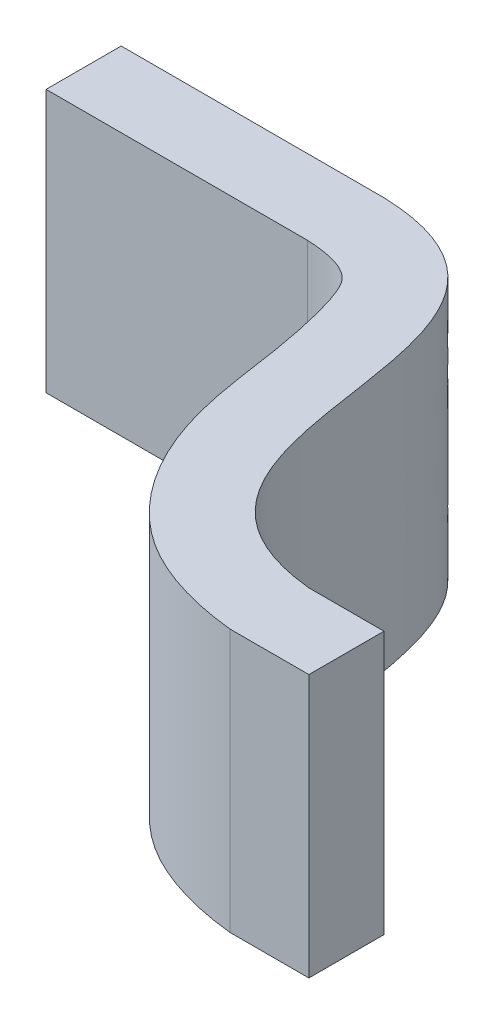
ISO-10303-21;
HEADER;
FILE_DESCRIPTION(('STEP AP214'),'2;1');
FILE_NAME('part.step','',(''),(''),'','','');
FILE_SCHEMA(('AUTOMOTIVE_DESIGN { 1 0 10303 214 1 1 1 1 }'));
ENDSEC;
DATA;
#1=APPLICATION_CONTEXT('core data for automotive mechanical design processes');
#2=APPLICATION_PROTOCOL_DEFINITION('international standard','automotive_design',2000,#1);
#3=PRODUCT_CONTEXT('',#1,'mechanical');
#4=PRODUCT('Part','Part','',(#3));
#5=PRODUCT_RELATED_PRODUCT_CATEGORY('part','',(#4));
#6=PRODUCT_DEFINITION_FORMATION('','',#4);
#7=PRODUCT_DEFINITION_CONTEXT('part definition',#1,'design');
#8=PRODUCT_DEFINITION('design','',#6,#7);
#9=PRODUCT_DEFINITION_SHAPE('','',#8);
#10=(LENGTH_UNIT() NAMED_UNIT(*) SI_UNIT(.MILLI.,.METRE.));
#11=(NAMED_UNIT(*) PLANE_ANGLE_UNIT() SI_UNIT($,.RADIAN.));
#12=(NAMED_UNIT(*) SI_UNIT($,.STERADIAN.) SOLID_ANGLE_UNIT());
#13=UNCERTAINTY_MEASURE_WITH_UNIT(LENGTH_MEASURE(1.E-05),#10,'distance_accuracy_value','');
#14=(GEOMETRIC_REPRESENTATION_CONTEXT(3) GLOBAL_UNCERTAINTY_ASSIGNED_CONTEXT((#13)) GLOBAL_UNIT_ASSIGNED_CONTEXT((#10,
#11,#12)) REPRESENTATION_CONTEXT('',''));
#15=CARTESIAN_POINT('',(0.,0.,0.));
#16=DIRECTION('',(0.,0.,1.));
#17=DIRECTION('',(1.,0.,0.));
#18=AXIS2_PLACEMENT_3D('',#15,#16,#17);
#19=CARTESIAN_POINT('',(0.381062000989914,-3.47687603414217,1.19999985356685));
#20=DIRECTION('',(0.,-1.,-4.37113882867379E-08));
#21=DIRECTION('',(1.,0.,0.));
#22=AXIS2_PLACEMENT_3D('',#19,#20,#21);
#23=PLANE('',#22);
#24=CARTESIAN_POINT('',(-6.65393799901009,-3.47687602539989,0.999999853566849));
#25=CARTESIAN_POINT('',(-6.67603378247592,-3.47687602530467,0.997821363378807));
#26=CARTESIAN_POINT('',(-6.69814608533159,-3.47687602516058,0.994524992319807));
#27=CARTESIAN_POINT('',(-6.74196000230599,-3.47687602474309,0.984973999806053));
#28=CARTESIAN_POINT('',(-6.76365439120462,-3.47687602446828,0.978687133446072));
#29=CARTESIAN_POINT('',(-6.80109928914061,-3.47687602383577,0.964217061903686));
#30=CARTESIAN_POINT('',(-6.81711598043367,-3.47687602350913,0.95674415768129));
#31=CARTESIAN_POINT('',(-6.84771104371223,-3.47687602275081,0.93939591098382));
#32=CARTESIAN_POINT('',(-6.86229582381613,-3.47687602231964,0.929532028551954));
#33=CARTESIAN_POINT('',(-6.88913715455262,-3.47687602137223,0.907857820702243));
#34=CARTESIAN_POINT('',(-6.90145549336788,-3.47687602085934,0.896124080689937));
#35=CARTESIAN_POINT('',(-6.92410333203055,-3.47687601975463,0.870851202194948));
#36=CARTESIAN_POINT('',(-6.93442941955475,-3.47687601916268,0.857309032186525));
#37=CARTESIAN_POINT('',(-6.96672356560466,-3.47687601701589,0.80819639399189));
#38=CARTESIAN_POINT('',(-6.98364579428103,-3.47687601531836,0.769361408858454));
#39=CARTESIAN_POINT('',(-7.00637915120374,-3.47687601228944,0.700067620687223));
#40=CARTESIAN_POINT('',(-7.01393277364121,-3.47687601097706,0.670043871769164));
#41=CARTESIAN_POINT('',(-7.02681062279047,-3.47687600832878,0.609458291277651));
#42=CARTESIAN_POINT('',(-7.03213106678493,-3.47687600699284,0.578895637360987));
#43=CARTESIAN_POINT('',(-7.04523612787774,-3.476876003414,0.497021351625422));
#44=CARTESIAN_POINT('',(-7.0522656284455,-3.4768760011665,0.445604528778749));
#45=CARTESIAN_POINT('',(-7.06583829430569,-3.47687599781692,0.368975045837082));
#46=CARTESIAN_POINT('',(-7.0708647695897,-3.47687599670442,0.34352407936554));
#47=CARTESIAN_POINT('',(-7.08290131021325,-3.4768759945012,0.293120201610463));
#48=CARTESIAN_POINT('',(-7.08990811721131,-3.47687599341044,0.268166543683047));
#49=CARTESIAN_POINT('',(-7.10754242158977,-3.47687599122937,0.218269493752244));
#50=CARTESIAN_POINT('',(-7.11830963205074,-3.47687599014101,0.193370554013012));
#51=CARTESIAN_POINT('',(-7.13814509854049,-3.47687598860283,0.158181114031217));
#52=CARTESIAN_POINT('',(-7.14534233177561,-3.47687598810726,0.146843820328251));
#53=CARTESIAN_POINT('',(-7.16105988122924,-3.47687598715831,0.12513440622176));
#54=CARTESIAN_POINT('',(-7.16957893209141,-3.47687598670489,0.114761377771715));
#55=CARTESIAN_POINT('',(-7.19091439754605,-3.47687598571421,0.0920974605824842));
#56=CARTESIAN_POINT('',(-7.20423043199209,-3.47687598519713,0.0802678988908227));
#57=CARTESIAN_POINT('',(-7.23280529274656,-3.47687598427693,0.0592160823492717));
#58=CARTESIAN_POINT('',(-7.24806736713441,-3.476875983874,0.0499982715306272));
#59=CARTESIAN_POINT('',(-7.28055680499388,-3.47687598316908,0.0338716888207497));
#60=CARTESIAN_POINT('',(-7.29784019259106,-3.47687598287213,0.0270780092305782));
#61=CARTESIAN_POINT('',(-7.33320890349723,-3.47687598238776,0.015996926953099));
#62=CARTESIAN_POINT('',(-7.35129600434054,-3.4768759822006,0.0117154108145131));
#63=CARTESIAN_POINT('',(-7.383534227059,-3.47687598194947,0.00597036540082539));
#64=CARTESIAN_POINT('',(-7.39761496113673,-3.47687598186692,0.00408168117578884));
#65=CARTESIAN_POINT('',(-7.42577624030721,-3.47687598174668,0.00133069078066433));
#66=CARTESIAN_POINT('',(-7.43985605615936,-3.47687598170867,0.000461089362856915));
#67=CARTESIAN_POINT('',(-7.45393799901012,-3.4768759816885,-1.46433151940948E-07));
#68=B_SPLINE_CURVE_WITH_KNOTS('',3,(#24,#25,#26,#27,#28,#29,#30,#31,#32,#33,#34,#35,#36,#37,#38,
#39,#40,#41,#42,#43,#44,#45,#46,#47,#48,#49,#50,#51,#52,#53,#54,#55,#56,#57,#58,#59,#60,#61,#62,
#63,#64,#65,#66,#67),.UNSPECIFIED.,.F.,.F.,(4,2,2,2,2,2,2,2,2,2,2,2,2,2,2,2,2,2,2,2,2,4),(0.,
0.0667821137090835,0.134301214684022,0.187128508823985,0.239707439757734,0.290518731452927,
0.341416294675053,0.466712259088968,0.559563019654505,0.652570428897917,0.808245450373591,
0.886023921415192,0.963675157190782,1.0445878496654,1.08478909463836,1.12495209032637,
1.17807587168456,1.23128951042009,1.2867700351769,1.34238004906254,1.38496468867344,
1.42724258099922),.UNSPECIFIED.);
#69=CARTESIAN_POINT('',(-6.65393799901009,-3.47687602539989,0.999999853566849));
#70=VERTEX_POINT('',#69);
#71=CARTESIAN_POINT('',(-7.45393799901009,-3.4768759816885,-1.46433150760572E-07));
#72=VERTEX_POINT('',#71);
#73=EDGE_CURVE('E11',#70,#72,#68,.T.);
#74=ORIENTED_EDGE('',*,*,#73,.F.);
#75=DIRECTION('',(-1.,0.,0.));
#76=VECTOR('',#75,1.);
#77=CARTESIAN_POINT('',(-6.45393799901009,-3.47687602539989,0.999999853566849));
#78=LINE('',#77,#76);
#79=CARTESIAN_POINT('',(-6.45393799901009,-3.47687602539989,0.999999853566849));
#80=VERTEX_POINT('',#79);
#81=EDGE_CURVE('E178',#80,#70,#78,.T.);
#82=ORIENTED_EDGE('',*,*,#81,.F.);
#83=DIRECTION('',(0.,4.37113878426487E-08,-0.999999999999999));
#84=VECTOR('',#83,1.);
#85=CARTESIAN_POINT('',(-6.45393799901009,-3.47687603414217,1.19999985356685));
#86=LINE('',#85,#84);
#87=CARTESIAN_POINT('',(-6.45393799901009,-3.47687603414217,1.19999985356685));
#88=VERTEX_POINT('',#87);
#89=EDGE_CURVE('E154',#88,#80,#86,.T.);
#90=ORIENTED_EDGE('',*,*,#89,.F.);
#91=DIRECTION('',(-1.,0.,0.));
#92=VECTOR('',#91,1.);
#93=CARTESIAN_POINT('',(-6.45393799901009,-3.47687603414216,1.19999985356685));
#94=LINE('',#93,#92);
#95=CARTESIAN_POINT('',(-6.66373717585809,-3.47687603414217,1.19999985356685));
#96=VERTEX_POINT('',#95);
#97=EDGE_CURVE('E147',#88,#96,#94,.T.);
#98=ORIENTED_EDGE('',*,*,#97,.T.);
#99=CARTESIAN_POINT('',(-6.66373717585809,-3.47687603414217,1.19999985356685));
#100=CARTESIAN_POINT('',(-6.68237056257263,-3.47687603406166,1.19815800024526));
#101=CARTESIAN_POINT('',(-6.70094738722954,-3.47687603395427,1.1957012238173));
#102=CARTESIAN_POINT('',(-6.73792461054779,-3.47687603368307,1.18949682423011));
#103=CARTESIAN_POINT('',(-6.75632454194431,-3.47687603351913,1.18574642673535));
#104=CARTESIAN_POINT('',(-6.7929675339705,-3.47687603313076,1.1768614504023));
#105=CARTESIAN_POINT('',(-6.81120769181061,-3.47687603290579,1.17171471620827));
#106=CARTESIAN_POINT('',(-6.84718412122,-3.47687603239066,1.15992992349783));
#107=CARTESIAN_POINT('',(-6.86492077676558,-3.47687603210055,1.15329303778762));
#108=CARTESIAN_POINT('',(-6.90550702441668,-3.47687603133701,1.13582532460973));
#109=CARTESIAN_POINT('',(-6.92808530032362,-3.47687603083472,1.12433411949994));
#110=CARTESIAN_POINT('',(-6.97098069443299,-3.47687602967858,1.09788489937365));
#111=CARTESIAN_POINT('',(-6.99130790145501,-3.47687602902546,1.08294336266544));
#112=CARTESIAN_POINT('',(-7.0279727762332,-3.47687602765227,1.05152836561377));
#113=CARTESIAN_POINT('',(-7.04449924398274,-3.47687602694167,1.03527166959651));
#114=CARTESIAN_POINT('',(-7.07543365798621,-3.47687602543449,1.00079135092782));
#115=CARTESIAN_POINT('',(-7.08983601944683,-3.47687602463769,0.98256275412625));
#116=CARTESIAN_POINT('',(-7.11809776879426,-3.47687602287818,0.942309972603253));
#117=CARTESIAN_POINT('',(-7.13168204827002,-3.47687602190706,0.92009318612408));
#118=CARTESIAN_POINT('',(-7.15606790009834,-3.47687601990227,0.874228970980329));
#119=CARTESIAN_POINT('',(-7.16687319447414,-3.47687601886869,0.850583508813255));
#120=CARTESIAN_POINT('',(-7.18657911699553,-3.4768760166685,0.800248980346848));
#121=CARTESIAN_POINT('',(-7.19524763842127,-3.47687601549796,0.773470089068371));
#122=CARTESIAN_POINT('',(-7.20996785968964,-3.4768760131256,0.719196833192921));
#123=CARTESIAN_POINT('',(-7.21601637646933,-3.47687601192374,0.691701641089337));
#124=CARTESIAN_POINT('',(-7.22445706680594,-3.47687600995746,0.646718436338351));
#125=CARTESIAN_POINT('',(-7.22737168105378,-3.47687600919702,0.629321297123909));
#126=CARTESIAN_POINT('',(-7.23282112861414,-3.4768760076734,0.594464888859918));
#127=CARTESIAN_POINT('',(-7.23535587567411,-3.47687600691023,0.57700560661871));
#128=CARTESIAN_POINT('',(-7.24044379035748,-3.47687600538413,0.542092659422762));
#129=CARTESIAN_POINT('',(-7.24299695433449,-3.47687600462121,0.524638994034041));
#130=CARTESIAN_POINT('',(-7.24854024165721,-3.47687600309859,0.489805448400219));
#131=CARTESIAN_POINT('',(-7.25153024685593,-3.47687600233889,0.472425549508169));
#132=CARTESIAN_POINT('',(-7.25940543221582,-3.47687600048514,0.430016740032559));
#133=CARTESIAN_POINT('',(-7.26454124775706,-3.47687599939302,0.405032011816055));
#134=CARTESIAN_POINT('',(-7.27335782095331,-3.47687599776612,0.367812734985583));
#135=CARTESIAN_POINT('',(-7.27648289514104,-3.4768759972256,0.355446814341552));
#136=CARTESIAN_POINT('',(-7.2832453862984,-3.47687599615076,0.33085792341073));
#137=CARTESIAN_POINT('',(-7.28688251537886,-3.47687599561644,0.318634876950397));
#138=CARTESIAN_POINT('',(-7.29335647517369,-3.47687599477455,0.29937322121594));
#139=CARTESIAN_POINT('',(-7.29591902475202,-3.47687599446296,0.29224380744469));
#140=CARTESIAN_POINT('',(-7.30149713681058,-3.47687599384772,0.278171719353253));
#141=CARTESIAN_POINT('',(-7.30451201316556,-3.47687599354405,0.271228780663557));
#142=CARTESIAN_POINT('',(-7.31077994191444,-3.47687599300993,0.258999768411458));
#143=CARTESIAN_POINT('',(-7.31388605246379,-3.47687599277632,0.253644591727611));
#144=CARTESIAN_POINT('',(-7.32081621454635,-3.47687599236733,0.244315850731122));
#145=CARTESIAN_POINT('',(-7.32451240161513,-3.47687599218833,0.240253829951383));
#146=CARTESIAN_POINT('',(-7.33396137139944,-3.47687599183599,0.232075819782309));
#147=CARTESIAN_POINT('',(-7.33999881820825,-3.47687599168021,0.228303905554504));
#148=CARTESIAN_POINT('',(-7.34921547868647,-3.47687599144317,0.223112945284578));
#149=CARTESIAN_POINT('',(-7.35230200427145,-3.4768759913639,0.221466013892202));
#150=CARTESIAN_POINT('',(-7.35859228869369,-3.47687599124101,0.218417225329415));
#151=CARTESIAN_POINT('',(-7.36179572518167,-3.47687599119728,0.217014747998717));
#152=CARTESIAN_POINT('',(-7.37091592035366,-3.47687599106817,0.21346489598315));
#153=CARTESIAN_POINT('',(-7.37694933123149,-3.47687599097749,0.211621552848283));
#154=CARTESIAN_POINT('',(-7.38671809463102,-3.47687599084498,0.209137060916209));
#155=CARTESIAN_POINT('',(-7.3904112741511,-3.47687599079807,0.208309546645722));
#156=CARTESIAN_POINT('',(-7.39782685498994,-3.47687599072394,0.206799511724329));
#157=CARTESIAN_POINT('',(-7.40154925199958,-3.47687599069671,0.206116970094036));
#158=CARTESIAN_POINT('',(-7.41391207862736,-3.47687599061041,0.204031929793531));
#159=CARTESIAN_POINT('',(-7.42259188256675,-3.47687599055652,0.20286096389716));
#160=CARTESIAN_POINT('',(-7.43564284724014,-3.47687599049499,0.201476448842085));
#161=CARTESIAN_POINT('',(-7.4399954739608,-3.4768759904777,0.201077075020748));
#162=CARTESIAN_POINT('',(-7.44871111958986,-3.47687599044948,0.200423844313514));
#163=CARTESIAN_POINT('',(-7.45307413753338,-3.47687599043856,0.200169974408029));
#164=CARTESIAN_POINT('',(-7.45744178074609,-3.47687599043078,0.199999853566849));
#165=B_SPLINE_CURVE_WITH_KNOTS('',3,(#99,#100,#101,#102,#103,#104,#105,#106,#107,#108,#109,#110,
#111,#112,#113,#114,#115,#116,#117,#118,#119,#120,#121,#122,#123,#124,#125,#126,#127,#128,#129,
#130,#131,#132,#133,#134,#135,#136,#137,#138,#139,#140,#141,#142,#143,#144,#145,#146,#147,#148,
#149,#150,#151,#152,#153,#154,#155,#156,#157,#158,#159,#160,#161,#162,#163,#164),.UNSPECIFIED.,
.F.,.F.,(4,2,2,2,2,2,2,2,2,2,2,2,2,2,2,2,2,2,2,2,2,2,2,2,2,2,2,2,2,2,2,2,4),(0.,
0.0561681589095697,0.112457534383135,0.169253578612363,0.226005077906877,0.301715004036535,
0.377070566345992,0.446424912055148,0.515958475234815,0.593880428548583,0.671697467408243,
0.755964517163008,0.840333658382208,0.893247792631838,0.946173923407371,0.999089848164162,
1.05199148781442,1.12847716172405,1.16673541076623,1.20497223539783,1.22769072756633,
1.25037510056686,1.26886797593494,1.28517999290264,1.30634908955326,1.31685139211729,
1.32732665061524,1.34619861049413,1.3575513722042,1.36890248990408,1.39515927363249,
1.40827024085607,1.42138003473644),.UNSPECIFIED.);
#166=CARTESIAN_POINT('',(-7.45744178074609,-3.47687599043078,0.199999853566849));
#167=VERTEX_POINT('',#166);
#168=EDGE_CURVE('E196',#96,#167,#165,.T.);
#169=ORIENTED_EDGE('',*,*,#168,.T.);
#170=DIRECTION('',(1.,0.,0.));
#171=VECTOR('',#170,1.);
#172=CARTESIAN_POINT('',(-8.15393799901009,-3.47687599043078,0.199999853566847));
#173=LINE('',#172,#171);
#174=CARTESIAN_POINT('',(-8.15393799901009,-3.47687599043078,0.199999853566849));
#175=VERTEX_POINT('',#174);
#176=EDGE_CURVE('E102',#175,#167,#173,.T.);
#177=ORIENTED_EDGE('',*,*,#176,.F.);
#178=DIRECTION('',(0.,4.37113900630947E-08,-0.999999999999999));
#179=VECTOR('',#178,1.);
#180=CARTESIAN_POINT('',(-8.15393799901009,-3.47687599043078,0.199999853566849));
#181=LINE('',#180,#179);
#182=CARTESIAN_POINT('',(-8.15393799901009,-3.4768759816885,-1.46433150760572E-07));
#183=VERTEX_POINT('',#182);
#184=EDGE_CURVE('E90',#175,#183,#181,.T.);
#185=ORIENTED_EDGE('',*,*,#184,.T.);
#186=DIRECTION('',(-1.,0.,0.));
#187=VECTOR('',#186,1.);
#188=CARTESIAN_POINT('',(-7.45393799901009,-3.4768759816885,-1.46433150760572E-07));
#189=LINE('',#188,#187);
#190=EDGE_CURVE('E100',#72,#183,#189,.T.);
#191=ORIENTED_EDGE('',*,*,#190,.F.);
#192=EDGE_LOOP('',(#74,#82,#90,#98,#169,#177,#185,#191));
#193=FACE_BOUND('',#192,.T.);
#194=ADVANCED_FACE('F17',(#193),#23,.T.);
#195=CARTESIAN_POINT('',(0.381062000989914,-2.77687603414217,1.19999988416482));
#196=DIRECTION('',(0.,-1.,-4.37113882867379E-08));
#197=DIRECTION('',(1.,0.,0.));
#198=AXIS2_PLACEMENT_3D('',#195,#196,#197);
#199=PLANE('',#198);
#200=DIRECTION('',(-1.,0.,0.));
#201=VECTOR('',#200,1.);
#202=CARTESIAN_POINT('',(-6.45393799901009,-2.77687602539989,0.999999884164821));
#203=LINE('',#202,#201);
#204=CARTESIAN_POINT('',(-6.45393799901009,-2.77687602539989,0.999999884164821));
#205=VERTEX_POINT('',#204);
#206=CARTESIAN_POINT('',(-6.65393799901009,-2.77687602539989,0.999999884164821));
#207=VERTEX_POINT('',#206);
#208=EDGE_CURVE('E30',#205,#207,#203,.T.);
#209=ORIENTED_EDGE('',*,*,#208,.T.);
#210=CARTESIAN_POINT('',(-6.65393799901009,-2.77687602539989,0.999999884164821));
#211=CARTESIAN_POINT('',(-6.67603378247592,-2.77687602530467,0.997821393976779));
#212=CARTESIAN_POINT('',(-6.69814608533159,-2.77687602516058,0.99452502291778));
#213=CARTESIAN_POINT('',(-6.74196000230599,-2.77687602474309,0.984974030404025));
#214=CARTESIAN_POINT('',(-6.76365439120462,-2.77687602446828,0.978687164044045));
#215=CARTESIAN_POINT('',(-6.80109928914061,-2.77687602383578,0.964217092501658));
#216=CARTESIAN_POINT('',(-6.81711598043367,-2.77687602350913,0.956744188279261));
#217=CARTESIAN_POINT('',(-6.84771104371223,-2.77687602275081,0.939395941581792));
#218=CARTESIAN_POINT('',(-6.86229582381613,-2.77687602231964,0.929532059149926));
#219=CARTESIAN_POINT('',(-6.88913715455262,-2.77687602137223,0.907857851300216));
#220=CARTESIAN_POINT('',(-6.90145549336788,-2.77687602085934,0.896124111287909));
#221=CARTESIAN_POINT('',(-6.92410333203055,-2.77687601975463,0.870851232792921));
#222=CARTESIAN_POINT('',(-6.93442941955475,-2.77687601916268,0.857309062784497));
#223=CARTESIAN_POINT('',(-6.96672356560466,-2.77687601701589,0.808196424589862));
#224=CARTESIAN_POINT('',(-6.98364579428104,-2.77687601531836,0.769361439456425));
#225=CARTESIAN_POINT('',(-7.00637915120374,-2.77687601228944,0.700067651285194));
#226=CARTESIAN_POINT('',(-7.01393277364121,-2.77687601097706,0.670043902367135));
#227=CARTESIAN_POINT('',(-7.02681062279047,-2.77687600832878,0.609458321875622));
#228=CARTESIAN_POINT('',(-7.03213106678493,-2.77687600699284,0.578895667958958));
#229=CARTESIAN_POINT('',(-7.04523612787774,-2.776876003414,0.497021382223394));
#230=CARTESIAN_POINT('',(-7.0522656284455,-2.7768760011665,0.44560455937672));
#231=CARTESIAN_POINT('',(-7.06583829430569,-2.77687599781692,0.368975076435053));
#232=CARTESIAN_POINT('',(-7.0708647695897,-2.77687599670443,0.343524109963512));
#233=CARTESIAN_POINT('',(-7.08290131021325,-2.7768759945012,0.293120232208435));
#234=CARTESIAN_POINT('',(-7.08990811721131,-2.77687599341044,0.268166574281019));
#235=CARTESIAN_POINT('',(-7.10754242158977,-2.77687599122937,0.218269524350216));
#236=CARTESIAN_POINT('',(-7.11830963205074,-2.77687599014101,0.193370584610984));
#237=CARTESIAN_POINT('',(-7.13814509854049,-2.77687598860283,0.158181144629188));
#238=CARTESIAN_POINT('',(-7.14534233177561,-2.77687598810726,0.146843850926222));
#239=CARTESIAN_POINT('',(-7.16105988122924,-2.77687598715831,0.125134436819731));
#240=CARTESIAN_POINT('',(-7.16957893209141,-2.77687598670489,0.114761408369685));
#241=CARTESIAN_POINT('',(-7.19091439754605,-2.77687598571422,0.0920974911804553));
#242=CARTESIAN_POINT('',(-7.20423043199209,-2.77687598519713,0.0802679294887945));
#243=CARTESIAN_POINT('',(-7.23280529274656,-2.77687598427693,0.0592161129472439));
#244=CARTESIAN_POINT('',(-7.24806736713441,-2.776875983874,0.0499983021285991));
#245=CARTESIAN_POINT('',(-7.28055680499388,-2.77687598316908,0.0338717194187214));
#246=CARTESIAN_POINT('',(-7.29784019259106,-2.77687598287213,0.02707803982855));
#247=CARTESIAN_POINT('',(-7.33320890349723,-2.77687598238776,0.0159969575510709));
#248=CARTESIAN_POINT('',(-7.35129600434054,-2.77687598220061,0.011715441412485));
#249=CARTESIAN_POINT('',(-7.383534227059,-2.77687598194948,0.00597039599879725));
#250=CARTESIAN_POINT('',(-7.39761496113673,-2.77687598186693,0.00408171177376066));
#251=CARTESIAN_POINT('',(-7.42577624030721,-2.77687598174668,0.00133072137863611));
#252=CARTESIAN_POINT('',(-7.43985605615936,-2.77687598170867,0.000461119960828672));
#253=CARTESIAN_POINT('',(-7.45393799901012,-2.7768759816885,-1.1583518018464E-07));
#254=B_SPLINE_CURVE_WITH_KNOTS('',3,(#210,#211,#212,#213,#214,#215,#216,#217,#218,#219,#220,
#221,#222,#223,#224,#225,#226,#227,#228,#229,#230,#231,#232,#233,#234,#235,#236,#237,#238,#239,
#240,#241,#242,#243,#244,#245,#246,#247,#248,#249,#250,#251,#252,#253),.UNSPECIFIED.,.F.,.F.,(4,
2,2,2,2,2,2,2,2,2,2,2,2,2,2,2,2,2,2,2,2,4),(0.,0.0667821137090835,0.134301214684022,
0.187128508823984,0.239707439757734,0.290518731452926,0.341416294675053,0.466712259088969,
0.559563019654506,0.652570428897918,0.808245450373592,0.886023921415192,0.963675157190782,
1.0445878496654,1.08478909463836,1.12495209032637,1.17807587168456,1.23128951042009,
1.2867700351769,1.34238004906254,1.38496468867344,1.42724258099922),.UNSPECIFIED.);
#255=CARTESIAN_POINT('',(-7.45393799901009,-2.7768759816885,-1.15835178959856E-07));
#256=VERTEX_POINT('',#255);
#257=EDGE_CURVE('E157',#207,#256,#254,.T.);
#258=ORIENTED_EDGE('',*,*,#257,.T.);
#259=DIRECTION('',(-1.,0.,0.));
#260=VECTOR('',#259,1.);
#261=CARTESIAN_POINT('',(-7.45393799901009,-2.7768759816885,-1.15835178959856E-07));
#262=LINE('',#261,#260);
#263=CARTESIAN_POINT('',(-8.15393799901009,-2.7768759816885,-1.15835178959856E-07));
#264=VERTEX_POINT('',#263);
#265=EDGE_CURVE('E150',#256,#264,#262,.T.);
#266=ORIENTED_EDGE('',*,*,#265,.T.);
#267=DIRECTION('',(0.,4.37113878426487E-08,-0.999999999999999));
#268=VECTOR('',#267,1.);
#269=CARTESIAN_POINT('',(-8.15393799901009,-2.77687599043078,0.199999884164821));
#270=LINE('',#269,#268);
#271=CARTESIAN_POINT('',(-8.15393799901009,-2.77687599043078,0.199999884164821));
#272=VERTEX_POINT('',#271);
#273=EDGE_CURVE('E93',#272,#264,#270,.T.);
#274=ORIENTED_EDGE('',*,*,#273,.F.);
#275=DIRECTION('',(1.,0.,0.));
#276=VECTOR('',#275,1.);
#277=CARTESIAN_POINT('',(-8.15393799901008,-2.77687599043078,0.199999884164819));
#278=LINE('',#277,#276);
#279=CARTESIAN_POINT('',(-7.45744178074609,-2.77687599043078,0.199999884164821));
#280=VERTEX_POINT('',#279);
#281=EDGE_CURVE('E193',#272,#280,#278,.T.);
#282=ORIENTED_EDGE('',*,*,#281,.T.);
#283=CARTESIAN_POINT('',(-6.66373717585809,-2.77687603414217,1.19999988416482));
#284=CARTESIAN_POINT('',(-6.68237056257263,-2.77687603406166,1.19815803084323));
#285=CARTESIAN_POINT('',(-6.70094738722954,-2.77687603395427,1.19570125441527));
#286=CARTESIAN_POINT('',(-6.73792461054779,-2.77687603368307,1.18949685482808));
#287=CARTESIAN_POINT('',(-6.75632454194431,-2.77687603351913,1.18574645733332));
#288=CARTESIAN_POINT('',(-6.7929675339705,-2.77687603313076,1.17686148100027));
#289=CARTESIAN_POINT('',(-6.81120769181061,-2.77687603290579,1.17171474680624));
#290=CARTESIAN_POINT('',(-6.84718412122,-2.77687603239066,1.1599299540958));
#291=CARTESIAN_POINT('',(-6.86492077676558,-2.77687603210055,1.15329306838559));
#292=CARTESIAN_POINT('',(-6.90550702441668,-2.77687603133701,1.1358253552077));
#293=CARTESIAN_POINT('',(-6.92808530032362,-2.77687603083472,1.12433415009791));
#294=CARTESIAN_POINT('',(-6.97098069443299,-2.77687602967858,1.09788492997162));
#295=CARTESIAN_POINT('',(-6.99130790145501,-2.77687602902546,1.08294339326341));
#296=CARTESIAN_POINT('',(-7.0279727762332,-2.77687602765227,1.05152839621174));
#297=CARTESIAN_POINT('',(-7.04449924398274,-2.77687602694167,1.03527170019448));
#298=CARTESIAN_POINT('',(-7.07543365798621,-2.77687602543449,1.00079138152579));
#299=CARTESIAN_POINT('',(-7.08983601944683,-2.77687602463769,0.982562784724221));
#300=CARTESIAN_POINT('',(-7.11809776879426,-2.77687602287818,0.942310003201224));
#301=CARTESIAN_POINT('',(-7.13168204827002,-2.77687602190706,0.920093216722051));
#302=CARTESIAN_POINT('',(-7.15606790009834,-2.77687601990227,0.874229001578301));
#303=CARTESIAN_POINT('',(-7.16687319447414,-2.77687601886869,0.850583539411227));
#304=CARTESIAN_POINT('',(-7.18657911699553,-2.7768760166685,0.80024901094482));
#305=CARTESIAN_POINT('',(-7.19524763842127,-2.77687601549796,0.773470119666343));
#306=CARTESIAN_POINT('',(-7.20996785968964,-2.7768760131256,0.719196863790894));
#307=CARTESIAN_POINT('',(-7.21601637646933,-2.77687601192374,0.691701671687309));
#308=CARTESIAN_POINT('',(-7.22445706680594,-2.77687600995746,0.646718466936323));
#309=CARTESIAN_POINT('',(-7.22737168105378,-2.77687600919702,0.629321327721881));
#310=CARTESIAN_POINT('',(-7.23282112861414,-2.7768760076734,0.59446491945789));
#311=CARTESIAN_POINT('',(-7.23535587567411,-2.77687600691023,0.577005637216683));
#312=CARTESIAN_POINT('',(-7.24044379035748,-2.77687600538413,0.542092690020734));
#313=CARTESIAN_POINT('',(-7.24299695433449,-2.77687600462121,0.524639024632014));
#314=CARTESIAN_POINT('',(-7.24854024165721,-2.77687600309859,0.489805478998191));
#315=CARTESIAN_POINT('',(-7.25153024685593,-2.77687600233889,0.47242558010614));
#316=CARTESIAN_POINT('',(-7.25940543221582,-2.77687600048514,0.430016770630531));
#317=CARTESIAN_POINT('',(-7.26454124775707,-2.77687599939301,0.405032042414027));
#318=CARTESIAN_POINT('',(-7.27335782095331,-2.77687599776612,0.367812765583555));
#319=CARTESIAN_POINT('',(-7.27648289514104,-2.7768759972256,0.355446844939524));
#320=CARTESIAN_POINT('',(-7.2832453862984,-2.77687599615075,0.330857954008701));
#321=CARTESIAN_POINT('',(-7.28688251537886,-2.77687599561642,0.318634907548368));
#322=CARTESIAN_POINT('',(-7.29335647517369,-2.77687599477456,0.299373251813911));
#323=CARTESIAN_POINT('',(-7.29591902475202,-2.776875994463,0.292243838042661));
#324=CARTESIAN_POINT('',(-7.30149713681058,-2.77687599384768,0.278171749951223));
#325=CARTESIAN_POINT('',(-7.30451201316556,-2.77687599354392,0.271228811261528));
#326=CARTESIAN_POINT('',(-7.31077994191444,-2.77687599301004,0.25899979900943));
#327=CARTESIAN_POINT('',(-7.31388605246379,-2.77687599277669,0.253644622325583));
#328=CARTESIAN_POINT('',(-7.32081621454635,-2.77687599236702,0.244315881329094));
#329=CARTESIAN_POINT('',(-7.32451240161513,-2.77687599218721,0.240253860549355));
#330=CARTESIAN_POINT('',(-7.33396137139944,-2.77687599183776,0.232075850380281));
#331=CARTESIAN_POINT('',(-7.33999881820825,-2.77687599168708,0.228303936152476));
#332=CARTESIAN_POINT('',(-7.34921547868647,-2.77687599144433,0.22311297588255));
#333=CARTESIAN_POINT('',(-7.35230200427145,-2.77687599136099,0.221466044490174));
#334=CARTESIAN_POINT('',(-7.35859228869369,-2.77687599124392,0.218417255927387));
#335=CARTESIAN_POINT('',(-7.36179572518167,-2.77687599121008,0.217014778596689));
#336=CARTESIAN_POINT('',(-7.37091592035366,-2.77687599109561,0.213464926581121));
#337=CARTESIAN_POINT('',(-7.37694933123149,-2.77687599099926,0.211621583446254));
#338=CARTESIAN_POINT('',(-7.38671809463102,-2.7768759908533,0.20913709151418));
#339=CARTESIAN_POINT('',(-7.3904112741511,-2.77687599080036,0.208309577243693));
#340=CARTESIAN_POINT('',(-7.39782685498994,-2.77687599072166,0.206799542322301));
#341=CARTESIAN_POINT('',(-7.40154925199958,-2.77687599069588,0.206117000692008));
#342=CARTESIAN_POINT('',(-7.41391207862736,-2.77687599061231,0.204031960391503));
#343=CARTESIAN_POINT('',(-7.42259188256675,-2.7768759905569,0.202860994495132));
#344=CARTESIAN_POINT('',(-7.43564284724014,-2.7768759904948,0.201476479440056));
#345=CARTESIAN_POINT('',(-7.4399954739608,-2.77687599047761,0.20107710561872));
#346=CARTESIAN_POINT('',(-7.44871111958986,-2.77687599044958,0.200423874911486));
#347=CARTESIAN_POINT('',(-7.45307413753338,-2.77687599043875,0.200170005006001));
#348=CARTESIAN_POINT('',(-7.45744178074609,-2.77687599043078,0.199999884164821));
#349=B_SPLINE_CURVE_WITH_KNOTS('',3,(#283,#284,#285,#286,#287,#288,#289,#290,#291,#292,#293,
#294,#295,#296,#297,#298,#299,#300,#301,#302,#303,#304,#305,#306,#307,#308,#309,#310,#311,#312,
#313,#314,#315,#316,#317,#318,#319,#320,#321,#322,#323,#324,#325,#326,#327,#328,#329,#330,#331,
#332,#333,#334,#335,#336,#337,#338,#339,#340,#341,#342,#343,#344,#345,#346,#347,#348),
.UNSPECIFIED.,.F.,.F.,(4,2,2,2,2,2,2,2,2,2,2,2,2,2,2,2,2,2,2,2,2,2,2,2,2,2,2,2,2,2,2,2,4),(0.,
0.0561681589095695,0.112457534383135,0.169253578612364,0.226005077906877,0.301715004036535,
0.377070566345993,0.446424912055147,0.515958475234815,0.593880428548582,0.671697467408241,
0.755964517163007,0.840333658382207,0.893247792631837,0.94617392340737,0.999089848164161,
1.05199148781441,1.12847716172405,1.16673541076623,1.20497223539783,1.22769072756633,
1.25037510056686,1.26886797593494,1.28517999290264,1.30634908955326,1.31685139211729,
1.32732665061524,1.34619861049413,1.3575513722042,1.36890248990408,1.39515927363249,
1.40827024085607,1.42138003473644),.UNSPECIFIED.);
#350=CARTESIAN_POINT('',(-6.66373717585809,-2.77687603414217,1.19999988416482));
#351=VERTEX_POINT('',#350);
#352=EDGE_CURVE('E98',#351,#280,#349,.T.);
#353=ORIENTED_EDGE('',*,*,#352,.F.);
#354=DIRECTION('',(-1.,0.,0.));
#355=VECTOR('',#354,1.);
#356=CARTESIAN_POINT('',(-6.45393799901009,-2.77687603414217,1.19999988416482));
#357=LINE('',#356,#355);
#358=CARTESIAN_POINT('',(-6.45393799901009,-2.77687603414217,1.19999988416482));
#359=VERTEX_POINT('',#358);
#360=EDGE_CURVE('E163',#359,#351,#357,.T.);
#361=ORIENTED_EDGE('',*,*,#360,.F.);
#362=DIRECTION('',(0.,4.37113878426487E-08,-0.999999999999999));
#363=VECTOR('',#362,1.);
#364=CARTESIAN_POINT('',(-6.45393799901009,-2.77687603414217,1.19999988416482));
#365=LINE('',#364,#363);
#366=EDGE_CURVE('E197',#359,#205,#365,.T.);
#367=ORIENTED_EDGE('',*,*,#366,.T.);
#368=EDGE_LOOP('',(#209,#258,#266,#274,#282,#353,#361,#367));
#369=FACE_BOUND('',#368,.T.);
#370=ADVANCED_FACE('F120',(#369),#199,.F.);
#371=CARTESIAN_POINT('',(0.381062000989914,-0.126876034142165,1.2));
#372=DIRECTION('',(0.,-4.37113882867379E-08,1.));
#373=DIRECTION('',(0.,-1.,-4.37113882867379E-08));
#374=AXIS2_PLACEMENT_3D('',#371,#372,#373);
#375=PLANE('',#374);
#376=ORIENTED_EDGE('',*,*,#360,.T.);
#377=DIRECTION('',(0.,-0.999999999999999,-4.37113881598552E-08));
#378=VECTOR('',#377,1.);
#379=CARTESIAN_POINT('',(-6.66373717585809,-2.77687603414217,1.19999988416482));
#380=LINE('',#379,#378);
#381=EDGE_CURVE('E152',#351,#96,#380,.T.);
#382=ORIENTED_EDGE('',*,*,#381,.T.);
#383=ORIENTED_EDGE('',*,*,#97,.F.);
#384=DIRECTION('',(0.,0.999999999999999,4.37113881598552E-08));
#385=VECTOR('',#384,1.);
#386=CARTESIAN_POINT('',(-6.45393799901008,-3.47687603414217,1.19999985356685));
#387=LINE('',#386,#385);
#388=EDGE_CURVE('E191',#88,#359,#387,.T.);
#389=ORIENTED_EDGE('',*,*,#388,.T.);
#390=EDGE_LOOP('',(#376,#382,#383,#389));
#391=FACE_BOUND('',#390,.T.);
#392=ADVANCED_FACE('F171',(#391),#375,.T.);
#393=CARTESIAN_POINT('',(-6.45393799901009,-0.126876034142165,1.2));
#394=DIRECTION('',(-1.,0.,0.));
#395=DIRECTION('',(0.,-1.,-4.37113882867379E-08));
#396=AXIS2_PLACEMENT_3D('',#393,#394,#395);
#397=PLANE('',#396);
#398=ORIENTED_EDGE('',*,*,#89,.T.);
#399=DIRECTION('',(0.,-0.999999999999999,-4.3711388159856E-08));
#400=VECTOR('',#399,1.);
#401=CARTESIAN_POINT('',(-6.45393799901009,-2.77687602539989,0.999999884164821));
#402=LINE('',#401,#400);
#403=EDGE_CURVE('E139',#205,#80,#402,.T.);
#404=ORIENTED_EDGE('',*,*,#403,.F.);
#405=ORIENTED_EDGE('',*,*,#366,.F.);
#406=ORIENTED_EDGE('',*,*,#388,.F.);
#407=EDGE_LOOP('',(#398,#404,#405,#406));
#408=FACE_BOUND('',#407,.T.);
#409=ADVANCED_FACE('F209',(#408),#397,.F.);
#410=CARTESIAN_POINT('',(-8.15393799901009,-0.126876034142165,1.2));
#411=DIRECTION('',(-1.,0.,0.));
#412=DIRECTION('',(0.,-1.,-4.37113882867379E-08));
#413=AXIS2_PLACEMENT_3D('',#410,#411,#412);
#414=PLANE('',#413);
#415=DIRECTION('',(0.,-0.999999999999999,-4.37113886356658E-08));
#416=VECTOR('',#415,1.);
#417=CARTESIAN_POINT('',(-8.15393799901009,-2.77687599043078,0.199999884164821));
#418=LINE('',#417,#416);
#419=EDGE_CURVE('E145',#272,#175,#418,.T.);
#420=ORIENTED_EDGE('',*,*,#419,.F.);
#421=ORIENTED_EDGE('',*,*,#273,.T.);
#422=DIRECTION('',(0.,0.999999999999999,4.37113882867379E-08));
#423=VECTOR('',#422,1.);
#424=CARTESIAN_POINT('',(-8.15393799901008,-3.4768759816885,-1.46433150760572E-07));
#425=LINE('',#424,#423);
#426=EDGE_CURVE('E87',#183,#264,#425,.T.);
#427=ORIENTED_EDGE('',*,*,#426,.F.);
#428=ORIENTED_EDGE('',*,*,#184,.F.);
#429=EDGE_LOOP('',(#420,#421,#427,#428));
#430=FACE_BOUND('',#429,.T.);
#431=ADVANCED_FACE('F89',(#430),#414,.T.);
#432=CARTESIAN_POINT('',(0.381062000989914,-0.126875981688499,0.));
#433=DIRECTION('',(0.,-4.37113882867379E-08,1.));
#434=DIRECTION('',(0.,-1.,-4.37113882867379E-08));
#435=AXIS2_PLACEMENT_3D('',#432,#433,#434);
#436=PLANE('',#435);
#437=ORIENTED_EDGE('',*,*,#265,.F.);
#438=DIRECTION('',(0.,-0.999999999999999,-4.37113882867379E-08));
#439=VECTOR('',#438,1.);
#440=CARTESIAN_POINT('',(-7.45393799901009,-2.7768759816885,-1.15835178959856E-07));
#441=LINE('',#440,#439);
#442=EDGE_CURVE('E97',#256,#72,#441,.T.);
#443=ORIENTED_EDGE('',*,*,#442,.T.);
#444=ORIENTED_EDGE('',*,*,#190,.T.);
#445=ORIENTED_EDGE('',*,*,#426,.T.);
#446=EDGE_LOOP('',(#437,#443,#444,#445));
#447=FACE_BOUND('',#446,.T.);
#448=ADVANCED_FACE('F105',(#447),#436,.F.);
#449=CARTESIAN_POINT('',(0.381062000989914,5.01775443609411,1.00000022487894));
#450=DIRECTION('',(0.,-4.37113882867379E-08,1.));
#451=DIRECTION('',(0.,-1.,-4.37113882867379E-08));
#452=AXIS2_PLACEMENT_3D('',#449,#450,#451);
#453=PLANE('',#452);
#454=ORIENTED_EDGE('',*,*,#403,.T.);
#455=ORIENTED_EDGE('',*,*,#81,.T.);
#456=DIRECTION('',(0.,-0.999999999999999,-4.3711388159856E-08));
#457=VECTOR('',#456,1.);
#458=CARTESIAN_POINT('',(-6.65393799901008,-2.77687602539989,0.999999884164821));
#459=LINE('',#458,#457);
#460=EDGE_CURVE('E103',#207,#70,#459,.T.);
#461=ORIENTED_EDGE('',*,*,#460,.F.);
#462=ORIENTED_EDGE('',*,*,#208,.F.);
#463=EDGE_LOOP('',(#454,#455,#461,#462));
#464=FACE_BOUND('',#463,.T.);
#465=ADVANCED_FACE('F169',(#464),#453,.F.);
#466=CARTESIAN_POINT('',(-6.65393799901009,5.01775443609411,1.00000022487894));
#467=CARTESIAN_POINT('',(-7.29925539715409,5.01775443886489,0.93661226287194));
#468=CARTESIAN_POINT('',(-6.78984128963709,5.01775447886606,0.0214920441178097));
#469=CARTESIAN_POINT('',(-7.45393799901009,5.0177544798055,2.24878939694144E-07));
#470=B_SPLINE_CURVE_WITH_KNOTS('',3,(#466,#467,#468,#469),.UNSPECIFIED.,.F.,.F.,(4,4),(0.,1.),.UNSPECIFIED.);
#471=DIRECTION('',(0.,-0.999999999999999,-4.37113882867379E-08));
#472=VECTOR('',#471,1.);
#473=SURFACE_OF_LINEAR_EXTRUSION('',#470,#472);
#474=ORIENTED_EDGE('',*,*,#460,.T.);
#475=ORIENTED_EDGE('',*,*,#73,.T.);
#476=ORIENTED_EDGE('',*,*,#442,.F.);
#477=ORIENTED_EDGE('',*,*,#257,.F.);
#478=EDGE_LOOP('',(#474,#475,#476,#477));
#479=FACE_BOUND('',#478,.T.);
#480=ADVANCED_FACE('F165',(#479),#473,.F.);
#481=CARTESIAN_POINT('',(0.381062000989914,5.01775447106322,0.20000022487894));
#482=DIRECTION('',(0.,4.37113882867379E-08,-1.));
#483=DIRECTION('',(1.,0.,0.));
#484=AXIS2_PLACEMENT_3D('',#481,#482,#483);
#485=PLANE('',#484);
#486=ORIENTED_EDGE('',*,*,#419,.T.);
#487=ORIENTED_EDGE('',*,*,#176,.T.);
#488=DIRECTION('',(0.,-0.999999999999999,-4.37113886356658E-08));
#489=VECTOR('',#488,1.);
#490=CARTESIAN_POINT('',(-7.45744178074609,-2.77687599043078,0.199999884164821));
#491=LINE('',#490,#489);
#492=EDGE_CURVE('E107',#280,#167,#491,.T.);
#493=ORIENTED_EDGE('',*,*,#492,.F.);
#494=ORIENTED_EDGE('',*,*,#281,.F.);
#495=EDGE_LOOP('',(#486,#487,#493,#494));
#496=FACE_BOUND('',#495,.T.);
#497=ADVANCED_FACE('F128',(#496),#485,.F.);
#498=CARTESIAN_POINT('',(-6.66373717585809,5.01775442735183,1.20000022487894));
#499=CARTESIAN_POINT('',(-6.76111157736509,5.01775442776993,1.19043537372094));
#500=CARTESIAN_POINT('',(-6.96545999269509,5.01775443018266,1.13523848292794));
#501=CARTESIAN_POINT('',(-7.20605275525609,5.01775444236442,0.85655227210794));
#502=CARTESIAN_POINT('',(-7.23834982502609,5.01775445822105,0.49379478761794));
#503=CARTESIAN_POINT('',(-7.29819788966409,5.01775446848464,0.25899132482694));
#504=CARTESIAN_POINT('',(-7.33605449676609,5.0177544697967,0.22897490490494));
#505=CARTESIAN_POINT('',(-7.37899552435409,5.01775447070118,0.20828275194794));
#506=CARTESIAN_POINT('',(-7.43390389640609,5.01775447102387,0.20090043049794));
#507=CARTESIAN_POINT('',(-7.45744178074609,5.01775447106322,0.20000022487894));
#508=B_SPLINE_CURVE_WITH_KNOTS('',3,(#498,#499,#500,#501,#502,#503,#504,#505,#506,#507),
.UNSPECIFIED.,.F.,.F.,(4,1,1,1,1,1,1,4),(-0.005037439357121,0.120331553469,0.245700546295,
0.496438531947,0.747176517599,0.872545510425,0.935230006838,0.997914503251),.UNSPECIFIED.);
#509=DIRECTION('',(0.,-0.999999999999999,-4.37113882867379E-08));
#510=VECTOR('',#509,1.);
#511=SURFACE_OF_LINEAR_EXTRUSION('',#508,#510);
#512=ORIENTED_EDGE('',*,*,#352,.T.);
#513=ORIENTED_EDGE('',*,*,#492,.T.);
#514=ORIENTED_EDGE('',*,*,#168,.F.);
#515=ORIENTED_EDGE('',*,*,#381,.F.);
#516=EDGE_LOOP('',(#512,#513,#514,#515));
#517=FACE_BOUND('',#516,.T.);
#518=ADVANCED_FACE('F122',(#517),#511,.T.);
#519=CLOSED_SHELL('',(#194,#370,#392,#409,#431,#448,#465,#480,#497,#518));
#520=MANIFOLD_SOLID_BREP('B1',#519);
#521=ADVANCED_BREP_SHAPE_REPRESENTATION('',(#18,#520),#14);
#522=SHAPE_DEFINITION_REPRESENTATION(#9,#521);
ENDSEC;
END-ISO-10303-21;
